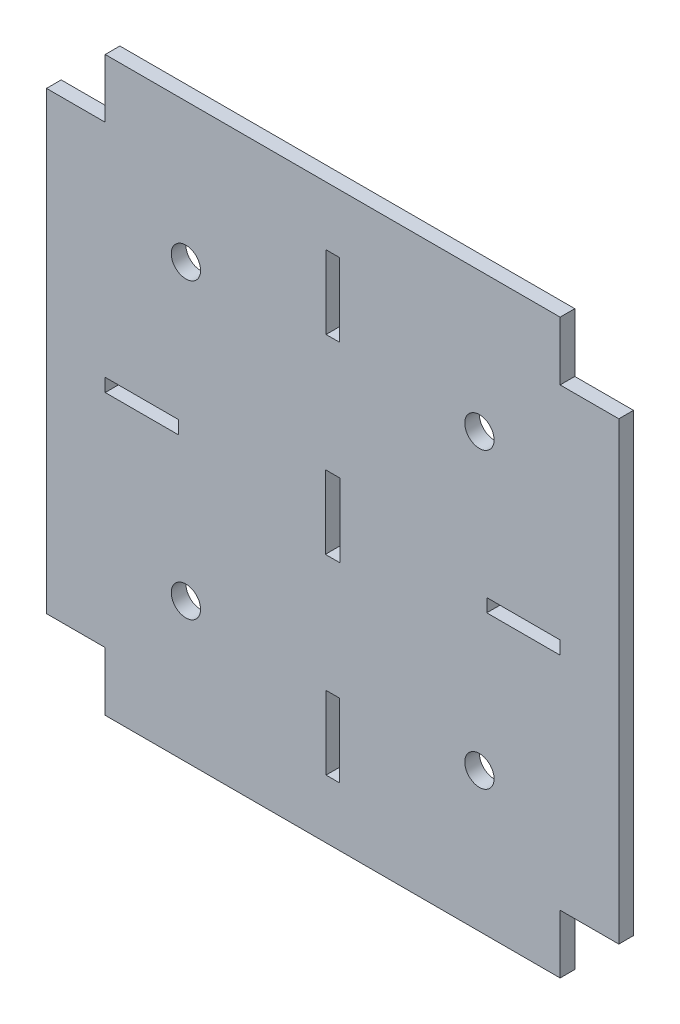
ISO-10303-21;
HEADER;
FILE_DESCRIPTION(('STEP AP214'),'2;1');
FILE_NAME('part.step','',(''),(''),'','','');
FILE_SCHEMA(('AUTOMOTIVE_DESIGN { 1 0 10303 214 1 1 1 1 }'));
ENDSEC;
DATA;
#1=APPLICATION_CONTEXT('core data for automotive mechanical design processes');
#2=APPLICATION_PROTOCOL_DEFINITION('international standard','automotive_design',2000,#1);
#3=PRODUCT_CONTEXT('',#1,'mechanical');
#4=PRODUCT('Part','Part','',(#3));
#5=PRODUCT_RELATED_PRODUCT_CATEGORY('part','',(#4));
#6=PRODUCT_DEFINITION_FORMATION('','',#4);
#7=PRODUCT_DEFINITION_CONTEXT('part definition',#1,'design');
#8=PRODUCT_DEFINITION('design','',#6,#7);
#9=PRODUCT_DEFINITION_SHAPE('','',#8);
#10=(LENGTH_UNIT() NAMED_UNIT(*) SI_UNIT(.MILLI.,.METRE.));
#11=(NAMED_UNIT(*) PLANE_ANGLE_UNIT() SI_UNIT($,.RADIAN.));
#12=(NAMED_UNIT(*) SI_UNIT($,.STERADIAN.) SOLID_ANGLE_UNIT());
#13=UNCERTAINTY_MEASURE_WITH_UNIT(LENGTH_MEASURE(1.E-05),#10,'distance_accuracy_value','');
#14=(GEOMETRIC_REPRESENTATION_CONTEXT(3) GLOBAL_UNCERTAINTY_ASSIGNED_CONTEXT((#13)) GLOBAL_UNIT_ASSIGNED_CONTEXT((#10,
#11,#12)) REPRESENTATION_CONTEXT('',''));
#15=CARTESIAN_POINT('',(0.,0.,0.));
#16=DIRECTION('',(0.,0.,1.));
#17=DIRECTION('',(1.,0.,0.));
#18=AXIS2_PLACEMENT_3D('',#15,#16,#17);
#19=CARTESIAN_POINT('',(0.,0.,2.));
#20=DIRECTION('',(0.,0.,1.));
#21=DIRECTION('',(1.,0.,0.));
#22=AXIS2_PLACEMENT_3D('',#19,#20,#21);
#23=PLANE('',#22);
#24=CARTESIAN_POINT('',(20.0000000000004,-20.,2.));
#25=DIRECTION('',(0.,0.,1.));
#26=DIRECTION('',(1.,0.,0.));
#27=AXIS2_PLACEMENT_3D('',#24,#25,#26);
#28=CIRCLE('',#27,2.);
#29=CARTESIAN_POINT('',(22.0000000000004,-20.,2.));
#30=VERTEX_POINT('',#29);
#31=EDGE_CURVE('E912',#30,#30,#28,.T.);
#32=ORIENTED_EDGE('',*,*,#31,.F.);
#33=EDGE_LOOP('',(#32));
#34=FACE_BOUND('',#33,.T.);
#35=DIRECTION('',(1.,0.,0.));
#36=VECTOR('',#35,1.);
#37=CARTESIAN_POINT('',(-0.999999999999997,-5.,2.));
#38=LINE('',#37,#36);
#39=CARTESIAN_POINT('',(-0.999999999999997,-5.,2.));
#40=VERTEX_POINT('',#39);
#41=CARTESIAN_POINT('',(1.,-5.,2.));
#42=VERTEX_POINT('',#41);
#43=EDGE_CURVE('E250',#40,#42,#38,.T.);
#44=ORIENTED_EDGE('',*,*,#43,.F.);
#45=DIRECTION('',(0.,-1.,0.));
#46=VECTOR('',#45,1.);
#47=CARTESIAN_POINT('',(-0.999999999999997,5.,2.));
#48=LINE('',#47,#46);
#49=CARTESIAN_POINT('',(-0.999999999999997,5.,2.));
#50=VERTEX_POINT('',#49);
#51=EDGE_CURVE('E242',#50,#40,#48,.T.);
#52=ORIENTED_EDGE('',*,*,#51,.F.);
#53=DIRECTION('',(-1.,0.,0.));
#54=VECTOR('',#53,1.);
#55=CARTESIAN_POINT('',(-0.999999999999997,5.,2.));
#56=LINE('',#55,#54);
#57=CARTESIAN_POINT('',(1.,5.,2.));
#58=VERTEX_POINT('',#57);
#59=EDGE_CURVE('E265',#58,#50,#56,.T.);
#60=ORIENTED_EDGE('',*,*,#59,.F.);
#61=DIRECTION('',(0.,1.,0.));
#62=VECTOR('',#61,1.);
#63=CARTESIAN_POINT('',(1.,5.,2.));
#64=LINE('',#63,#62);
#65=EDGE_CURVE('E263',#42,#58,#64,.T.);
#66=ORIENTED_EDGE('',*,*,#65,.F.);
#67=EDGE_LOOP('',(#44,#52,#60,#66));
#68=FACE_BOUND('',#67,.T.);
#69=CARTESIAN_POINT('',(-20.,20.,2.));
#70=DIRECTION('',(0.,0.,1.));
#71=DIRECTION('',(1.,0.,0.));
#72=AXIS2_PLACEMENT_3D('',#69,#70,#71);
#73=CIRCLE('',#72,2.);
#74=CARTESIAN_POINT('',(-18.,20.,2.));
#75=VERTEX_POINT('',#74);
#76=EDGE_CURVE('E281',#75,#75,#73,.T.);
#77=ORIENTED_EDGE('',*,*,#76,.F.);
#78=EDGE_LOOP('',(#77));
#79=FACE_BOUND('',#78,.T.);
#80=DIRECTION('',(0.,-1.,0.));
#81=VECTOR('',#80,1.);
#82=CARTESIAN_POINT('',(-31.,39.,2.));
#83=LINE('',#82,#81);
#84=CARTESIAN_POINT('',(-31.,39.,2.));
#85=VERTEX_POINT('',#84);
#86=CARTESIAN_POINT('',(-31.,31.,2.));
#87=VERTEX_POINT('',#86);
#88=EDGE_CURVE('E411',#85,#87,#83,.T.);
#89=ORIENTED_EDGE('',*,*,#88,.T.);
#90=DIRECTION('',(-1.,0.,0.));
#91=VECTOR('',#90,1.);
#92=CARTESIAN_POINT('',(-39.,31.,2.));
#93=LINE('',#92,#91);
#94=CARTESIAN_POINT('',(-39.,31.,2.));
#95=VERTEX_POINT('',#94);
#96=EDGE_CURVE('E414',#87,#95,#93,.T.);
#97=ORIENTED_EDGE('',*,*,#96,.T.);
#98=DIRECTION('',(0.,-1.,0.));
#99=VECTOR('',#98,1.);
#100=CARTESIAN_POINT('',(-39.,31.,2.));
#101=LINE('',#100,#99);
#102=CARTESIAN_POINT('',(-39.,-31.,2.));
#103=VERTEX_POINT('',#102);
#104=EDGE_CURVE('E417',#95,#103,#101,.T.);
#105=ORIENTED_EDGE('',*,*,#104,.T.);
#106=DIRECTION('',(1.,0.,0.));
#107=VECTOR('',#106,1.);
#108=CARTESIAN_POINT('',(-39.,-31.,2.));
#109=LINE('',#108,#107);
#110=CARTESIAN_POINT('',(-31.,-31.,2.));
#111=VERTEX_POINT('',#110);
#112=EDGE_CURVE('E419',#103,#111,#109,.T.);
#113=ORIENTED_EDGE('',*,*,#112,.T.);
#114=DIRECTION('',(0.,-1.,0.));
#115=VECTOR('',#114,1.);
#116=CARTESIAN_POINT('',(-31.,-39.,2.));
#117=LINE('',#116,#115);
#118=CARTESIAN_POINT('',(-31.,-39.,2.));
#119=VERTEX_POINT('',#118);
#120=EDGE_CURVE('E421',#111,#119,#117,.T.);
#121=ORIENTED_EDGE('',*,*,#120,.T.);
#122=DIRECTION('',(1.,0.,0.));
#123=VECTOR('',#122,1.);
#124=CARTESIAN_POINT('',(-31.,-39.,2.));
#125=LINE('',#124,#123);
#126=CARTESIAN_POINT('',(31.,-39.,2.));
#127=VERTEX_POINT('',#126);
#128=EDGE_CURVE('E423',#119,#127,#125,.T.);
#129=ORIENTED_EDGE('',*,*,#128,.T.);
#130=DIRECTION('',(0.,1.,0.));
#131=VECTOR('',#130,1.);
#132=CARTESIAN_POINT('',(31.,-39.,2.));
#133=LINE('',#132,#131);
#134=CARTESIAN_POINT('',(31.,-31.,2.));
#135=VERTEX_POINT('',#134);
#136=EDGE_CURVE('E425',#127,#135,#133,.T.);
#137=ORIENTED_EDGE('',*,*,#136,.T.);
#138=DIRECTION('',(1.,0.,0.));
#139=VECTOR('',#138,1.);
#140=CARTESIAN_POINT('',(39.,-31.,2.));
#141=LINE('',#140,#139);
#142=CARTESIAN_POINT('',(39.,-31.,2.));
#143=VERTEX_POINT('',#142);
#144=EDGE_CURVE('E427',#135,#143,#141,.T.);
#145=ORIENTED_EDGE('',*,*,#144,.T.);
#146=DIRECTION('',(0.,1.,0.));
#147=VECTOR('',#146,1.);
#148=CARTESIAN_POINT('',(39.,31.,2.));
#149=LINE('',#148,#147);
#150=CARTESIAN_POINT('',(39.,31.,2.));
#151=VERTEX_POINT('',#150);
#152=EDGE_CURVE('E429',#143,#151,#149,.T.);
#153=ORIENTED_EDGE('',*,*,#152,.T.);
#154=DIRECTION('',(-1.,0.,0.));
#155=VECTOR('',#154,1.);
#156=CARTESIAN_POINT('',(39.,31.,2.));
#157=LINE('',#156,#155);
#158=CARTESIAN_POINT('',(31.,31.,2.));
#159=VERTEX_POINT('',#158);
#160=EDGE_CURVE('E431',#151,#159,#157,.T.);
#161=ORIENTED_EDGE('',*,*,#160,.T.);
#162=DIRECTION('',(0.,1.,0.));
#163=VECTOR('',#162,1.);
#164=CARTESIAN_POINT('',(31.,39.,2.));
#165=LINE('',#164,#163);
#166=CARTESIAN_POINT('',(31.,39.,2.));
#167=VERTEX_POINT('',#166);
#168=EDGE_CURVE('E433',#159,#167,#165,.T.);
#169=ORIENTED_EDGE('',*,*,#168,.T.);
#170=DIRECTION('',(-1.,0.,0.));
#171=VECTOR('',#170,1.);
#172=CARTESIAN_POINT('',(-31.,39.,2.));
#173=LINE('',#172,#171);
#174=EDGE_CURVE('E435',#167,#85,#173,.T.);
#175=ORIENTED_EDGE('',*,*,#174,.T.);
#176=EDGE_LOOP('',(#89,#97,#105,#113,#121,#129,#137,#145,#153,#161,#169,#175));
#177=FACE_BOUND('',#176,.T.);
#178=DIRECTION('',(1.,0.,0.));
#179=VECTOR('',#178,1.);
#180=CARTESIAN_POINT('',(-0.900000000000001,21.,2.));
#181=LINE('',#180,#179);
#182=CARTESIAN_POINT('',(-0.900000000000001,21.,2.));
#183=VERTEX_POINT('',#182);
#184=CARTESIAN_POINT('',(0.900000000000001,21.,2.));
#185=VERTEX_POINT('',#184);
#186=EDGE_CURVE('E382',#183,#185,#181,.T.);
#187=ORIENTED_EDGE('',*,*,#186,.F.);
#188=DIRECTION('',(0.,-1.,0.));
#189=VECTOR('',#188,1.);
#190=CARTESIAN_POINT('',(-0.9,31.,2.));
#191=LINE('',#190,#189);
#192=CARTESIAN_POINT('',(-0.9,31.,2.));
#193=VERTEX_POINT('',#192);
#194=EDGE_CURVE('E380',#193,#183,#191,.T.);
#195=ORIENTED_EDGE('',*,*,#194,.F.);
#196=DIRECTION('',(-1.,0.,0.));
#197=VECTOR('',#196,1.);
#198=CARTESIAN_POINT('',(-0.9,31.,2.));
#199=LINE('',#198,#197);
#200=CARTESIAN_POINT('',(0.9,31.,2.));
#201=VERTEX_POINT('',#200);
#202=EDGE_CURVE('E388',#201,#193,#199,.T.);
#203=ORIENTED_EDGE('',*,*,#202,.F.);
#204=DIRECTION('',(0.,1.,0.));
#205=VECTOR('',#204,1.);
#206=CARTESIAN_POINT('',(0.9,31.,2.));
#207=LINE('',#206,#205);
#208=EDGE_CURVE('E385',#185,#201,#207,.T.);
#209=ORIENTED_EDGE('',*,*,#208,.F.);
#210=EDGE_LOOP('',(#187,#195,#203,#209));
#211=FACE_BOUND('',#210,.T.);
#212=DIRECTION('',(1.,0.,0.));
#213=VECTOR('',#212,1.);
#214=CARTESIAN_POINT('',(-31.,-0.900000000000004,2.));
#215=LINE('',#214,#213);
#216=CARTESIAN_POINT('',(-31.,-0.900000000000004,2.));
#217=VERTEX_POINT('',#216);
#218=CARTESIAN_POINT('',(-21.,-0.900000000000001,2.));
#219=VERTEX_POINT('',#218);
#220=EDGE_CURVE('E351',#217,#219,#215,.T.);
#221=ORIENTED_EDGE('',*,*,#220,.F.);
#222=DIRECTION('',(0.,-1.,0.));
#223=VECTOR('',#222,1.);
#224=CARTESIAN_POINT('',(-31.,0.899999999999996,2.));
#225=LINE('',#224,#223);
#226=CARTESIAN_POINT('',(-31.,0.899999999999996,2.));
#227=VERTEX_POINT('',#226);
#228=EDGE_CURVE('E349',#227,#217,#225,.T.);
#229=ORIENTED_EDGE('',*,*,#228,.F.);
#230=DIRECTION('',(-1.,0.,0.));
#231=VECTOR('',#230,1.);
#232=CARTESIAN_POINT('',(-31.,0.899999999999996,2.));
#233=LINE('',#232,#231);
#234=CARTESIAN_POINT('',(-21.,0.899999999999996,2.));
#235=VERTEX_POINT('',#234);
#236=EDGE_CURVE('E357',#235,#227,#233,.T.);
#237=ORIENTED_EDGE('',*,*,#236,.F.);
#238=DIRECTION('',(0.,1.,0.));
#239=VECTOR('',#238,1.);
#240=CARTESIAN_POINT('',(-21.,0.899999999999996,2.));
#241=LINE('',#240,#239);
#242=EDGE_CURVE('E354',#219,#235,#241,.T.);
#243=ORIENTED_EDGE('',*,*,#242,.F.);
#244=EDGE_LOOP('',(#221,#229,#237,#243));
#245=FACE_BOUND('',#244,.T.);
#246=DIRECTION('',(1.,0.,0.));
#247=VECTOR('',#246,1.);
#248=CARTESIAN_POINT('',(-0.900000000000007,-31.,2.));
#249=LINE('',#248,#247);
#250=CARTESIAN_POINT('',(-0.900000000000007,-31.,2.));
#251=VERTEX_POINT('',#250);
#252=CARTESIAN_POINT('',(0.900000000000007,-31.,2.));
#253=VERTEX_POINT('',#252);
#254=EDGE_CURVE('E320',#251,#253,#249,.T.);
#255=ORIENTED_EDGE('',*,*,#254,.F.);
#256=DIRECTION('',(0.,-1.,0.));
#257=VECTOR('',#256,1.);
#258=CARTESIAN_POINT('',(-0.900000000000007,-31.,2.));
#259=LINE('',#258,#257);
#260=CARTESIAN_POINT('',(-0.900000000000006,-21.,2.));
#261=VERTEX_POINT('',#260);
#262=EDGE_CURVE('E318',#261,#251,#259,.T.);
#263=ORIENTED_EDGE('',*,*,#262,.F.);
#264=DIRECTION('',(-1.,0.,0.));
#265=VECTOR('',#264,1.);
#266=CARTESIAN_POINT('',(-0.900000000000006,-21.,2.));
#267=LINE('',#266,#265);
#268=CARTESIAN_POINT('',(0.900000000000006,-21.,2.));
#269=VERTEX_POINT('',#268);
#270=EDGE_CURVE('E326',#269,#261,#267,.T.);
#271=ORIENTED_EDGE('',*,*,#270,.F.);
#272=DIRECTION('',(0.,1.,0.));
#273=VECTOR('',#272,1.);
#274=CARTESIAN_POINT('',(0.900000000000007,-31.,2.));
#275=LINE('',#274,#273);
#276=EDGE_CURVE('E323',#253,#269,#275,.T.);
#277=ORIENTED_EDGE('',*,*,#276,.F.);
#278=EDGE_LOOP('',(#255,#263,#271,#277));
#279=FACE_BOUND('',#278,.T.);
#280=DIRECTION('',(0.,-1.,0.));
#281=VECTOR('',#280,1.);
#282=CARTESIAN_POINT('',(21.,0.900000000000006,2.));
#283=LINE('',#282,#281);
#284=CARTESIAN_POINT('',(21.,0.900000000000006,2.));
#285=VERTEX_POINT('',#284);
#286=CARTESIAN_POINT('',(21.,-0.900000000000001,2.));
#287=VERTEX_POINT('',#286);
#288=EDGE_CURVE('E289',#285,#287,#283,.T.);
#289=ORIENTED_EDGE('',*,*,#288,.F.);
#290=DIRECTION('',(-1.,0.,0.));
#291=VECTOR('',#290,1.);
#292=CARTESIAN_POINT('',(31.,0.900000000000011,2.));
#293=LINE('',#292,#291);
#294=CARTESIAN_POINT('',(31.,0.900000000000011,2.));
#295=VERTEX_POINT('',#294);
#296=EDGE_CURVE('E287',#295,#285,#293,.T.);
#297=ORIENTED_EDGE('',*,*,#296,.F.);
#298=DIRECTION('',(0.,1.,0.));
#299=VECTOR('',#298,1.);
#300=CARTESIAN_POINT('',(31.,0.900000000000011,2.));
#301=LINE('',#300,#299);
#302=CARTESIAN_POINT('',(31.,-0.900000000000004,2.));
#303=VERTEX_POINT('',#302);
#304=EDGE_CURVE('E295',#303,#295,#301,.T.);
#305=ORIENTED_EDGE('',*,*,#304,.F.);
#306=DIRECTION('',(1.,0.,0.));
#307=VECTOR('',#306,1.);
#308=CARTESIAN_POINT('',(31.,-0.900000000000004,2.));
#309=LINE('',#308,#307);
#310=EDGE_CURVE('E292',#287,#303,#309,.T.);
#311=ORIENTED_EDGE('',*,*,#310,.F.);
#312=EDGE_LOOP('',(#289,#297,#305,#311));
#313=FACE_BOUND('',#312,.T.);
#314=CARTESIAN_POINT('',(20.,20.,2.));
#315=DIRECTION('',(0.,0.,1.));
#316=DIRECTION('',(1.,0.,0.));
#317=AXIS2_PLACEMENT_3D('',#314,#315,#316);
#318=CIRCLE('',#317,2.);
#319=CARTESIAN_POINT('',(22.,20.,2.));
#320=VERTEX_POINT('',#319);
#321=EDGE_CURVE('E271',#320,#320,#318,.T.);
#322=ORIENTED_EDGE('',*,*,#321,.F.);
#323=EDGE_LOOP('',(#322));
#324=FACE_BOUND('',#323,.T.);
#325=CARTESIAN_POINT('',(-19.9999999999996,-20.,2.));
#326=DIRECTION('',(0.,0.,1.));
#327=DIRECTION('',(1.,0.,0.));
#328=AXIS2_PLACEMENT_3D('',#325,#326,#327);
#329=CIRCLE('',#328,2.);
#330=CARTESIAN_POINT('',(-17.9999999999996,-20.,2.));
#331=VERTEX_POINT('',#330);
#332=EDGE_CURVE('E903',#331,#331,#329,.T.);
#333=ORIENTED_EDGE('',*,*,#332,.F.);
#334=EDGE_LOOP('',(#333));
#335=FACE_BOUND('',#334,.T.);
#336=ADVANCED_FACE('F33',(#34,#68,#79,#177,#211,#245,#279,#313,#324,#335),#23,.T.);
#337=CARTESIAN_POINT('',(0.,0.,0.));
#338=DIRECTION('',(0.,0.,1.));
#339=DIRECTION('',(1.,0.,0.));
#340=AXIS2_PLACEMENT_3D('',#337,#338,#339);
#341=PLANE('',#340);
#342=CARTESIAN_POINT('',(-20.,20.,0.));
#343=DIRECTION('',(0.,0.,1.));
#344=DIRECTION('',(1.,0.,0.));
#345=AXIS2_PLACEMENT_3D('',#342,#343,#344);
#346=CIRCLE('',#345,2.);
#347=CARTESIAN_POINT('',(-18.,20.,0.));
#348=VERTEX_POINT('',#347);
#349=EDGE_CURVE('E258',#348,#348,#346,.T.);
#350=ORIENTED_EDGE('',*,*,#349,.T.);
#351=EDGE_LOOP('',(#350));
#352=FACE_BOUND('',#351,.T.);
#353=DIRECTION('',(-1.,0.,0.));
#354=VECTOR('',#353,1.);
#355=CARTESIAN_POINT('',(31.,0.900000000000011,0.));
#356=LINE('',#355,#354);
#357=CARTESIAN_POINT('',(31.,0.900000000000011,0.));
#358=VERTEX_POINT('',#357);
#359=CARTESIAN_POINT('',(21.,0.900000000000006,0.));
#360=VERTEX_POINT('',#359);
#361=EDGE_CURVE('E284',#358,#360,#356,.T.);
#362=ORIENTED_EDGE('',*,*,#361,.T.);
#363=DIRECTION('',(0.,-1.,0.));
#364=VECTOR('',#363,1.);
#365=CARTESIAN_POINT('',(21.,0.900000000000006,0.));
#366=LINE('',#365,#364);
#367=CARTESIAN_POINT('',(21.,-0.900000000000001,0.));
#368=VERTEX_POINT('',#367);
#369=EDGE_CURVE('E300',#360,#368,#366,.T.);
#370=ORIENTED_EDGE('',*,*,#369,.T.);
#371=DIRECTION('',(1.,0.,0.));
#372=VECTOR('',#371,1.);
#373=CARTESIAN_POINT('',(31.,-0.900000000000004,0.));
#374=LINE('',#373,#372);
#375=CARTESIAN_POINT('',(31.,-0.900000000000004,0.));
#376=VERTEX_POINT('',#375);
#377=EDGE_CURVE('E303',#368,#376,#374,.T.);
#378=ORIENTED_EDGE('',*,*,#377,.T.);
#379=DIRECTION('',(0.,1.,0.));
#380=VECTOR('',#379,1.);
#381=CARTESIAN_POINT('',(31.,0.900000000000011,0.));
#382=LINE('',#381,#380);
#383=EDGE_CURVE('E290',#376,#358,#382,.T.);
#384=ORIENTED_EDGE('',*,*,#383,.T.);
#385=EDGE_LOOP('',(#362,#370,#378,#384));
#386=FACE_BOUND('',#385,.T.);
#387=DIRECTION('',(0.,-1.,0.));
#388=VECTOR('',#387,1.);
#389=CARTESIAN_POINT('',(-31.,0.899999999999996,0.));
#390=LINE('',#389,#388);
#391=CARTESIAN_POINT('',(-31.,0.899999999999996,0.));
#392=VERTEX_POINT('',#391);
#393=CARTESIAN_POINT('',(-31.,-0.900000000000004,0.));
#394=VERTEX_POINT('',#393);
#395=EDGE_CURVE('E348',#392,#394,#390,.T.);
#396=ORIENTED_EDGE('',*,*,#395,.T.);
#397=DIRECTION('',(1.,0.,0.));
#398=VECTOR('',#397,1.);
#399=CARTESIAN_POINT('',(-31.,-0.900000000000004,0.));
#400=LINE('',#399,#398);
#401=CARTESIAN_POINT('',(-21.,-0.900000000000001,0.));
#402=VERTEX_POINT('',#401);
#403=EDGE_CURVE('E362',#394,#402,#400,.T.);
#404=ORIENTED_EDGE('',*,*,#403,.T.);
#405=DIRECTION('',(0.,1.,0.));
#406=VECTOR('',#405,1.);
#407=CARTESIAN_POINT('',(-21.,0.899999999999996,0.));
#408=LINE('',#407,#406);
#409=CARTESIAN_POINT('',(-21.,0.899999999999996,0.));
#410=VERTEX_POINT('',#409);
#411=EDGE_CURVE('E365',#402,#410,#408,.T.);
#412=ORIENTED_EDGE('',*,*,#411,.T.);
#413=DIRECTION('',(-1.,0.,0.));
#414=VECTOR('',#413,1.);
#415=CARTESIAN_POINT('',(-31.,0.899999999999996,0.));
#416=LINE('',#415,#414);
#417=EDGE_CURVE('E352',#410,#392,#416,.T.);
#418=ORIENTED_EDGE('',*,*,#417,.T.);
#419=EDGE_LOOP('',(#396,#404,#412,#418));
#420=FACE_BOUND('',#419,.T.);
#421=DIRECTION('',(0.,-1.,0.));
#422=VECTOR('',#421,1.);
#423=CARTESIAN_POINT('',(-31.,39.,0.));
#424=LINE('',#423,#422);
#425=CARTESIAN_POINT('',(-31.,39.,0.));
#426=VERTEX_POINT('',#425);
#427=CARTESIAN_POINT('',(-31.,31.,0.));
#428=VERTEX_POINT('',#427);
#429=EDGE_CURVE('E410',#426,#428,#424,.T.);
#430=ORIENTED_EDGE('',*,*,#429,.F.);
#431=DIRECTION('',(-1.,0.,0.));
#432=VECTOR('',#431,1.);
#433=CARTESIAN_POINT('',(-31.,39.,0.));
#434=LINE('',#433,#432);
#435=CARTESIAN_POINT('',(31.,39.,0.));
#436=VERTEX_POINT('',#435);
#437=EDGE_CURVE('E415',#436,#426,#434,.T.);
#438=ORIENTED_EDGE('',*,*,#437,.F.);
#439=DIRECTION('',(0.,1.,0.));
#440=VECTOR('',#439,1.);
#441=CARTESIAN_POINT('',(31.,39.,0.));
#442=LINE('',#441,#440);
#443=CARTESIAN_POINT('',(31.,31.,0.));
#444=VERTEX_POINT('',#443);
#445=EDGE_CURVE('E458',#444,#436,#442,.T.);
#446=ORIENTED_EDGE('',*,*,#445,.F.);
#447=DIRECTION('',(-1.,0.,0.));
#448=VECTOR('',#447,1.);
#449=CARTESIAN_POINT('',(39.,31.,0.));
#450=LINE('',#449,#448);
#451=CARTESIAN_POINT('',(39.,31.,0.));
#452=VERTEX_POINT('',#451);
#453=EDGE_CURVE('E456',#452,#444,#450,.T.);
#454=ORIENTED_EDGE('',*,*,#453,.F.);
#455=DIRECTION('',(0.,1.,0.));
#456=VECTOR('',#455,1.);
#457=CARTESIAN_POINT('',(39.,31.,0.));
#458=LINE('',#457,#456);
#459=CARTESIAN_POINT('',(39.,-31.,0.));
#460=VERTEX_POINT('',#459);
#461=EDGE_CURVE('E454',#460,#452,#458,.T.);
#462=ORIENTED_EDGE('',*,*,#461,.F.);
#463=DIRECTION('',(1.,0.,0.));
#464=VECTOR('',#463,1.);
#465=CARTESIAN_POINT('',(39.,-31.,0.));
#466=LINE('',#465,#464);
#467=CARTESIAN_POINT('',(31.,-31.,0.));
#468=VERTEX_POINT('',#467);
#469=EDGE_CURVE('E452',#468,#460,#466,.T.);
#470=ORIENTED_EDGE('',*,*,#469,.F.);
#471=DIRECTION('',(0.,1.,0.));
#472=VECTOR('',#471,1.);
#473=CARTESIAN_POINT('',(31.,-39.,0.));
#474=LINE('',#473,#472);
#475=CARTESIAN_POINT('',(31.,-39.,0.));
#476=VERTEX_POINT('',#475);
#477=EDGE_CURVE('E450',#476,#468,#474,.T.);
#478=ORIENTED_EDGE('',*,*,#477,.F.);
#479=DIRECTION('',(1.,0.,0.));
#480=VECTOR('',#479,1.);
#481=CARTESIAN_POINT('',(-31.,-39.,0.));
#482=LINE('',#481,#480);
#483=CARTESIAN_POINT('',(-31.,-39.,0.));
#484=VERTEX_POINT('',#483);
#485=EDGE_CURVE('E448',#484,#476,#482,.T.);
#486=ORIENTED_EDGE('',*,*,#485,.F.);
#487=DIRECTION('',(0.,-1.,0.));
#488=VECTOR('',#487,1.);
#489=CARTESIAN_POINT('',(-31.,-39.,0.));
#490=LINE('',#489,#488);
#491=CARTESIAN_POINT('',(-31.,-31.,0.));
#492=VERTEX_POINT('',#491);
#493=EDGE_CURVE('E446',#492,#484,#490,.T.);
#494=ORIENTED_EDGE('',*,*,#493,.F.);
#495=DIRECTION('',(1.,0.,0.));
#496=VECTOR('',#495,1.);
#497=CARTESIAN_POINT('',(-39.,-31.,0.));
#498=LINE('',#497,#496);
#499=CARTESIAN_POINT('',(-39.,-31.,0.));
#500=VERTEX_POINT('',#499);
#501=EDGE_CURVE('E444',#500,#492,#498,.T.);
#502=ORIENTED_EDGE('',*,*,#501,.F.);
#503=DIRECTION('',(0.,-1.,0.));
#504=VECTOR('',#503,1.);
#505=CARTESIAN_POINT('',(-39.,31.,0.));
#506=LINE('',#505,#504);
#507=CARTESIAN_POINT('',(-39.,31.,0.));
#508=VERTEX_POINT('',#507);
#509=EDGE_CURVE('E442',#508,#500,#506,.T.);
#510=ORIENTED_EDGE('',*,*,#509,.F.);
#511=DIRECTION('',(-1.,0.,0.));
#512=VECTOR('',#511,1.);
#513=CARTESIAN_POINT('',(-39.,31.,0.));
#514=LINE('',#513,#512);
#515=EDGE_CURVE('E440',#428,#508,#514,.T.);
#516=ORIENTED_EDGE('',*,*,#515,.F.);
#517=EDGE_LOOP('',(#430,#438,#446,#454,#462,#470,#478,#486,#494,#502,#510,#516));
#518=FACE_BOUND('',#517,.T.);
#519=DIRECTION('',(0.,-1.,0.));
#520=VECTOR('',#519,1.);
#521=CARTESIAN_POINT('',(-0.9,31.,0.));
#522=LINE('',#521,#520);
#523=CARTESIAN_POINT('',(-0.9,31.,0.));
#524=VERTEX_POINT('',#523);
#525=CARTESIAN_POINT('',(-0.900000000000001,21.,0.));
#526=VERTEX_POINT('',#525);
#527=EDGE_CURVE('E379',#524,#526,#522,.T.);
#528=ORIENTED_EDGE('',*,*,#527,.T.);
#529=DIRECTION('',(1.,0.,0.));
#530=VECTOR('',#529,1.);
#531=CARTESIAN_POINT('',(-0.900000000000001,21.,0.));
#532=LINE('',#531,#530);
#533=CARTESIAN_POINT('',(0.900000000000001,21.,0.));
#534=VERTEX_POINT('',#533);
#535=EDGE_CURVE('E393',#526,#534,#532,.T.);
#536=ORIENTED_EDGE('',*,*,#535,.T.);
#537=DIRECTION('',(0.,1.,0.));
#538=VECTOR('',#537,1.);
#539=CARTESIAN_POINT('',(0.9,31.,0.));
#540=LINE('',#539,#538);
#541=CARTESIAN_POINT('',(0.9,31.,0.));
#542=VERTEX_POINT('',#541);
#543=EDGE_CURVE('E396',#534,#542,#540,.T.);
#544=ORIENTED_EDGE('',*,*,#543,.T.);
#545=DIRECTION('',(-1.,0.,0.));
#546=VECTOR('',#545,1.);
#547=CARTESIAN_POINT('',(-0.9,31.,0.));
#548=LINE('',#547,#546);
#549=EDGE_CURVE('E383',#542,#524,#548,.T.);
#550=ORIENTED_EDGE('',*,*,#549,.T.);
#551=EDGE_LOOP('',(#528,#536,#544,#550));
#552=FACE_BOUND('',#551,.T.);
#553=DIRECTION('',(0.,-1.,0.));
#554=VECTOR('',#553,1.);
#555=CARTESIAN_POINT('',(-0.900000000000007,-31.,0.));
#556=LINE('',#555,#554);
#557=CARTESIAN_POINT('',(-0.900000000000006,-21.,0.));
#558=VERTEX_POINT('',#557);
#559=CARTESIAN_POINT('',(-0.900000000000007,-31.,0.));
#560=VERTEX_POINT('',#559);
#561=EDGE_CURVE('E317',#558,#560,#556,.T.);
#562=ORIENTED_EDGE('',*,*,#561,.T.);
#563=DIRECTION('',(1.,0.,0.));
#564=VECTOR('',#563,1.);
#565=CARTESIAN_POINT('',(-0.900000000000007,-31.,0.));
#566=LINE('',#565,#564);
#567=CARTESIAN_POINT('',(0.900000000000007,-31.,0.));
#568=VERTEX_POINT('',#567);
#569=EDGE_CURVE('E331',#560,#568,#566,.T.);
#570=ORIENTED_EDGE('',*,*,#569,.T.);
#571=DIRECTION('',(0.,1.,0.));
#572=VECTOR('',#571,1.);
#573=CARTESIAN_POINT('',(0.900000000000007,-31.,0.));
#574=LINE('',#573,#572);
#575=CARTESIAN_POINT('',(0.900000000000006,-21.,0.));
#576=VERTEX_POINT('',#575);
#577=EDGE_CURVE('E334',#568,#576,#574,.T.);
#578=ORIENTED_EDGE('',*,*,#577,.T.);
#579=DIRECTION('',(-1.,0.,0.));
#580=VECTOR('',#579,1.);
#581=CARTESIAN_POINT('',(-0.900000000000006,-21.,0.));
#582=LINE('',#581,#580);
#583=EDGE_CURVE('E321',#576,#558,#582,.T.);
#584=ORIENTED_EDGE('',*,*,#583,.T.);
#585=EDGE_LOOP('',(#562,#570,#578,#584));
#586=FACE_BOUND('',#585,.T.);
#587=DIRECTION('',(0.,-1.,0.));
#588=VECTOR('',#587,1.);
#589=CARTESIAN_POINT('',(-0.999999999999997,5.,0.));
#590=LINE('',#589,#588);
#591=CARTESIAN_POINT('',(-0.999999999999997,5.,0.));
#592=VERTEX_POINT('',#591);
#593=CARTESIAN_POINT('',(-0.999999999999997,-5.,0.));
#594=VERTEX_POINT('',#593);
#595=EDGE_CURVE('E56',#592,#594,#590,.T.);
#596=ORIENTED_EDGE('',*,*,#595,.T.);
#597=DIRECTION('',(1.,0.,0.));
#598=VECTOR('',#597,1.);
#599=CARTESIAN_POINT('',(-0.999999999999997,-5.,0.));
#600=LINE('',#599,#598);
#601=CARTESIAN_POINT('',(1.,-5.,0.));
#602=VERTEX_POINT('',#601);
#603=EDGE_CURVE('E257',#594,#602,#600,.T.);
#604=ORIENTED_EDGE('',*,*,#603,.T.);
#605=DIRECTION('',(0.,1.,0.));
#606=VECTOR('',#605,1.);
#607=CARTESIAN_POINT('',(1.,5.,0.));
#608=LINE('',#607,#606);
#609=CARTESIAN_POINT('',(1.,5.,0.));
#610=VERTEX_POINT('',#609);
#611=EDGE_CURVE('E273',#602,#610,#608,.T.);
#612=ORIENTED_EDGE('',*,*,#611,.T.);
#613=DIRECTION('',(-1.,0.,0.));
#614=VECTOR('',#613,1.);
#615=CARTESIAN_POINT('',(-0.999999999999997,5.,0.));
#616=LINE('',#615,#614);
#617=EDGE_CURVE('E251',#610,#592,#616,.T.);
#618=ORIENTED_EDGE('',*,*,#617,.T.);
#619=EDGE_LOOP('',(#596,#604,#612,#618));
#620=FACE_BOUND('',#619,.T.);
#621=CARTESIAN_POINT('',(20.,20.,0.));
#622=DIRECTION('',(0.,0.,1.));
#623=DIRECTION('',(1.,0.,0.));
#624=AXIS2_PLACEMENT_3D('',#621,#622,#623);
#625=CIRCLE('',#624,2.);
#626=CARTESIAN_POINT('',(22.,20.,0.));
#627=VERTEX_POINT('',#626);
#628=EDGE_CURVE('E915',#627,#627,#625,.T.);
#629=ORIENTED_EDGE('',*,*,#628,.T.);
#630=EDGE_LOOP('',(#629));
#631=FACE_BOUND('',#630,.T.);
#632=CARTESIAN_POINT('',(20.0000000000004,-20.,0.));
#633=DIRECTION('',(0.,0.,1.));
#634=DIRECTION('',(1.,0.,0.));
#635=AXIS2_PLACEMENT_3D('',#632,#633,#634);
#636=CIRCLE('',#635,2.);
#637=CARTESIAN_POINT('',(22.0000000000004,-20.,0.));
#638=VERTEX_POINT('',#637);
#639=EDGE_CURVE('E909',#638,#638,#636,.T.);
#640=ORIENTED_EDGE('',*,*,#639,.T.);
#641=EDGE_LOOP('',(#640));
#642=FACE_BOUND('',#641,.T.);
#643=CARTESIAN_POINT('',(-19.9999999999996,-20.,0.));
#644=DIRECTION('',(0.,0.,1.));
#645=DIRECTION('',(1.,0.,0.));
#646=AXIS2_PLACEMENT_3D('',#643,#644,#645);
#647=CIRCLE('',#646,2.);
#648=CARTESIAN_POINT('',(-17.9999999999996,-20.,0.));
#649=VERTEX_POINT('',#648);
#650=EDGE_CURVE('E906',#649,#649,#647,.T.);
#651=ORIENTED_EDGE('',*,*,#650,.T.);
#652=EDGE_LOOP('',(#651));
#653=FACE_BOUND('',#652,.T.);
#654=ADVANCED_FACE('F500',(#352,#386,#420,#518,#552,#586,#620,#631,#642,#653),#341,.F.);
#655=CARTESIAN_POINT('',(-31.,39.,2.));
#656=DIRECTION('',(1.,0.,0.));
#657=DIRECTION('',(0.,0.,-1.));
#658=AXIS2_PLACEMENT_3D('',#655,#656,#657);
#659=PLANE('',#658);
#660=ORIENTED_EDGE('',*,*,#429,.T.);
#661=DIRECTION('',(0.,0.,-1.));
#662=VECTOR('',#661,1.);
#663=CARTESIAN_POINT('',(-31.,31.,2.));
#664=LINE('',#663,#662);
#665=EDGE_CURVE('E11',#87,#428,#664,.T.);
#666=ORIENTED_EDGE('',*,*,#665,.F.);
#667=ORIENTED_EDGE('',*,*,#88,.F.);
#668=DIRECTION('',(0.,0.,-1.));
#669=VECTOR('',#668,1.);
#670=CARTESIAN_POINT('',(-31.,39.,2.));
#671=LINE('',#670,#669);
#672=EDGE_CURVE('E437',#85,#426,#671,.T.);
#673=ORIENTED_EDGE('',*,*,#672,.T.);
#674=EDGE_LOOP('',(#660,#666,#667,#673));
#675=FACE_BOUND('',#674,.T.);
#676=ADVANCED_FACE('F35',(#675),#659,.F.);
#677=CARTESIAN_POINT('',(-39.,31.,2.));
#678=DIRECTION('',(0.,-1.,0.));
#679=DIRECTION('',(0.,0.,-1.));
#680=AXIS2_PLACEMENT_3D('',#677,#678,#679);
#681=PLANE('',#680);
#682=ORIENTED_EDGE('',*,*,#515,.T.);
#683=DIRECTION('',(0.,0.,-1.));
#684=VECTOR('',#683,1.);
#685=CARTESIAN_POINT('',(-39.,31.,2.));
#686=LINE('',#685,#684);
#687=EDGE_CURVE('E41',#95,#508,#686,.T.);
#688=ORIENTED_EDGE('',*,*,#687,.F.);
#689=ORIENTED_EDGE('',*,*,#96,.F.);
#690=ORIENTED_EDGE('',*,*,#665,.T.);
#691=EDGE_LOOP('',(#682,#688,#689,#690));
#692=FACE_BOUND('',#691,.T.);
#693=ADVANCED_FACE('F518',(#692),#681,.F.);
#694=CARTESIAN_POINT('',(-39.,31.,2.));
#695=DIRECTION('',(1.,0.,0.));
#696=DIRECTION('',(0.,1.,0.));
#697=AXIS2_PLACEMENT_3D('',#694,#695,#696);
#698=PLANE('',#697);
#699=ORIENTED_EDGE('',*,*,#509,.T.);
#700=DIRECTION('',(0.,0.,-1.));
#701=VECTOR('',#700,1.);
#702=CARTESIAN_POINT('',(-39.,-31.,2.));
#703=LINE('',#702,#701);
#704=EDGE_CURVE('E487',#103,#500,#703,.T.);
#705=ORIENTED_EDGE('',*,*,#704,.F.);
#706=ORIENTED_EDGE('',*,*,#104,.F.);
#707=ORIENTED_EDGE('',*,*,#687,.T.);
#708=EDGE_LOOP('',(#699,#705,#706,#707));
#709=FACE_BOUND('',#708,.T.);
#710=ADVANCED_FACE('F494',(#709),#698,.F.);
#711=CARTESIAN_POINT('',(-39.,-31.,2.));
#712=DIRECTION('',(0.,1.,0.));
#713=DIRECTION('',(-1.,0.,0.));
#714=AXIS2_PLACEMENT_3D('',#711,#712,#713);
#715=PLANE('',#714);
#716=ORIENTED_EDGE('',*,*,#501,.T.);
#717=DIRECTION('',(0.,0.,-1.));
#718=VECTOR('',#717,1.);
#719=CARTESIAN_POINT('',(-31.,-31.,2.));
#720=LINE('',#719,#718);
#721=EDGE_CURVE('E484',#111,#492,#720,.T.);
#722=ORIENTED_EDGE('',*,*,#721,.F.);
#723=ORIENTED_EDGE('',*,*,#112,.F.);
#724=ORIENTED_EDGE('',*,*,#704,.T.);
#725=EDGE_LOOP('',(#716,#722,#723,#724));
#726=FACE_BOUND('',#725,.T.);
#727=ADVANCED_FACE('F506',(#726),#715,.F.);
#728=CARTESIAN_POINT('',(-31.,-39.,2.));
#729=DIRECTION('',(1.,0.,0.));
#730=DIRECTION('',(0.,1.,0.));
#731=AXIS2_PLACEMENT_3D('',#728,#729,#730);
#732=PLANE('',#731);
#733=ORIENTED_EDGE('',*,*,#493,.T.);
#734=DIRECTION('',(0.,0.,-1.));
#735=VECTOR('',#734,1.);
#736=CARTESIAN_POINT('',(-31.,-39.,2.));
#737=LINE('',#736,#735);
#738=EDGE_CURVE('E481',#119,#484,#737,.T.);
#739=ORIENTED_EDGE('',*,*,#738,.F.);
#740=ORIENTED_EDGE('',*,*,#120,.F.);
#741=ORIENTED_EDGE('',*,*,#721,.T.);
#742=EDGE_LOOP('',(#733,#739,#740,#741));
#743=FACE_BOUND('',#742,.T.);
#744=ADVANCED_FACE('F510',(#743),#732,.F.);
#745=CARTESIAN_POINT('',(-31.,-39.,2.));
#746=DIRECTION('',(0.,1.,0.));
#747=DIRECTION('',(-1.,0.,0.));
#748=AXIS2_PLACEMENT_3D('',#745,#746,#747);
#749=PLANE('',#748);
#750=ORIENTED_EDGE('',*,*,#485,.T.);
#751=DIRECTION('',(0.,0.,-1.));
#752=VECTOR('',#751,1.);
#753=CARTESIAN_POINT('',(31.,-39.,2.));
#754=LINE('',#753,#752);
#755=EDGE_CURVE('E478',#127,#476,#754,.T.);
#756=ORIENTED_EDGE('',*,*,#755,.F.);
#757=ORIENTED_EDGE('',*,*,#128,.F.);
#758=ORIENTED_EDGE('',*,*,#738,.T.);
#759=EDGE_LOOP('',(#750,#756,#757,#758));
#760=FACE_BOUND('',#759,.T.);
#761=ADVANCED_FACE('F551',(#760),#749,.F.);
#762=CARTESIAN_POINT('',(31.,-39.,2.));
#763=DIRECTION('',(-1.,0.,0.));
#764=DIRECTION('',(0.,0.,1.));
#765=AXIS2_PLACEMENT_3D('',#762,#763,#764);
#766=PLANE('',#765);
#767=ORIENTED_EDGE('',*,*,#477,.T.);
#768=DIRECTION('',(0.,0.,-1.));
#769=VECTOR('',#768,1.);
#770=CARTESIAN_POINT('',(31.,-31.,2.));
#771=LINE('',#770,#769);
#772=EDGE_CURVE('E475',#135,#468,#771,.T.);
#773=ORIENTED_EDGE('',*,*,#772,.F.);
#774=ORIENTED_EDGE('',*,*,#136,.F.);
#775=ORIENTED_EDGE('',*,*,#755,.T.);
#776=EDGE_LOOP('',(#767,#773,#774,#775));
#777=FACE_BOUND('',#776,.T.);
#778=ADVANCED_FACE('F549',(#777),#766,.F.);
#779=CARTESIAN_POINT('',(39.,-31.,2.));
#780=DIRECTION('',(0.,1.,0.));
#781=DIRECTION('',(-1.,0.,0.));
#782=AXIS2_PLACEMENT_3D('',#779,#780,#781);
#783=PLANE('',#782);
#784=ORIENTED_EDGE('',*,*,#469,.T.);
#785=DIRECTION('',(0.,0.,-1.));
#786=VECTOR('',#785,1.);
#787=CARTESIAN_POINT('',(39.,-31.,2.));
#788=LINE('',#787,#786);
#789=EDGE_CURVE('E472',#143,#460,#788,.T.);
#790=ORIENTED_EDGE('',*,*,#789,.F.);
#791=ORIENTED_EDGE('',*,*,#144,.F.);
#792=ORIENTED_EDGE('',*,*,#772,.T.);
#793=EDGE_LOOP('',(#784,#790,#791,#792));
#794=FACE_BOUND('',#793,.T.);
#795=ADVANCED_FACE('F545',(#794),#783,.F.);
#796=CARTESIAN_POINT('',(39.,31.,2.));
#797=DIRECTION('',(-1.,0.,0.));
#798=DIRECTION('',(0.,-1.,0.));
#799=AXIS2_PLACEMENT_3D('',#796,#797,#798);
#800=PLANE('',#799);
#801=ORIENTED_EDGE('',*,*,#461,.T.);
#802=DIRECTION('',(0.,0.,-1.));
#803=VECTOR('',#802,1.);
#804=CARTESIAN_POINT('',(39.,31.,2.));
#805=LINE('',#804,#803);
#806=EDGE_CURVE('E469',#151,#452,#805,.T.);
#807=ORIENTED_EDGE('',*,*,#806,.F.);
#808=ORIENTED_EDGE('',*,*,#152,.F.);
#809=ORIENTED_EDGE('',*,*,#789,.T.);
#810=EDGE_LOOP('',(#801,#807,#808,#809));
#811=FACE_BOUND('',#810,.T.);
#812=ADVANCED_FACE('F540',(#811),#800,.F.);
#813=CARTESIAN_POINT('',(39.,31.,2.));
#814=DIRECTION('',(0.,-1.,0.));
#815=DIRECTION('',(1.,0.,0.));
#816=AXIS2_PLACEMENT_3D('',#813,#814,#815);
#817=PLANE('',#816);
#818=ORIENTED_EDGE('',*,*,#453,.T.);
#819=DIRECTION('',(0.,0.,-1.));
#820=VECTOR('',#819,1.);
#821=CARTESIAN_POINT('',(31.,31.,2.));
#822=LINE('',#821,#820);
#823=EDGE_CURVE('E466',#159,#444,#822,.T.);
#824=ORIENTED_EDGE('',*,*,#823,.F.);
#825=ORIENTED_EDGE('',*,*,#160,.F.);
#826=ORIENTED_EDGE('',*,*,#806,.T.);
#827=EDGE_LOOP('',(#818,#824,#825,#826));
#828=FACE_BOUND('',#827,.T.);
#829=ADVANCED_FACE('F534',(#828),#817,.F.);
#830=CARTESIAN_POINT('',(31.,39.,2.));
#831=DIRECTION('',(-1.,0.,0.));
#832=DIRECTION('',(0.,-1.,0.));
#833=AXIS2_PLACEMENT_3D('',#830,#831,#832);
#834=PLANE('',#833);
#835=ORIENTED_EDGE('',*,*,#445,.T.);
#836=DIRECTION('',(0.,0.,-1.));
#837=VECTOR('',#836,1.);
#838=CARTESIAN_POINT('',(31.,39.,2.));
#839=LINE('',#838,#837);
#840=EDGE_CURVE('E463',#167,#436,#839,.T.);
#841=ORIENTED_EDGE('',*,*,#840,.F.);
#842=ORIENTED_EDGE('',*,*,#168,.F.);
#843=ORIENTED_EDGE('',*,*,#823,.T.);
#844=EDGE_LOOP('',(#835,#841,#842,#843));
#845=FACE_BOUND('',#844,.T.);
#846=ADVANCED_FACE('F530',(#845),#834,.F.);
#847=CARTESIAN_POINT('',(-31.,39.,2.));
#848=DIRECTION('',(0.,-1.,0.));
#849=DIRECTION('',(0.,0.,-1.));
#850=AXIS2_PLACEMENT_3D('',#847,#848,#849);
#851=PLANE('',#850);
#852=ORIENTED_EDGE('',*,*,#437,.T.);
#853=ORIENTED_EDGE('',*,*,#672,.F.);
#854=ORIENTED_EDGE('',*,*,#174,.F.);
#855=ORIENTED_EDGE('',*,*,#840,.T.);
#856=EDGE_LOOP('',(#852,#853,#854,#855));
#857=FACE_BOUND('',#856,.T.);
#858=ADVANCED_FACE('F525',(#857),#851,.F.);
#859=CARTESIAN_POINT('',(-0.9,31.,2.));
#860=DIRECTION('',(1.,0.,0.));
#861=DIRECTION('',(0.,1.,0.));
#862=AXIS2_PLACEMENT_3D('',#859,#860,#861);
#863=PLANE('',#862);
#864=ORIENTED_EDGE('',*,*,#527,.F.);
#865=DIRECTION('',(0.,0.,-1.));
#866=VECTOR('',#865,1.);
#867=CARTESIAN_POINT('',(-0.9,31.,2.));
#868=LINE('',#867,#866);
#869=EDGE_CURVE('E390',#193,#524,#868,.T.);
#870=ORIENTED_EDGE('',*,*,#869,.F.);
#871=ORIENTED_EDGE('',*,*,#194,.T.);
#872=DIRECTION('',(0.,0.,-1.));
#873=VECTOR('',#872,1.);
#874=CARTESIAN_POINT('',(-0.900000000000001,21.,2.));
#875=LINE('',#874,#873);
#876=EDGE_CURVE('E407',#183,#526,#875,.T.);
#877=ORIENTED_EDGE('',*,*,#876,.T.);
#878=EDGE_LOOP('',(#864,#870,#871,#877));
#879=FACE_BOUND('',#878,.T.);
#880=ADVANCED_FACE('F570',(#879),#863,.T.);
#881=CARTESIAN_POINT('',(-0.900000000000001,21.,2.));
#882=DIRECTION('',(0.,1.,0.));
#883=DIRECTION('',(0.,0.,1.));
#884=AXIS2_PLACEMENT_3D('',#881,#882,#883);
#885=PLANE('',#884);
#886=ORIENTED_EDGE('',*,*,#535,.F.);
#887=ORIENTED_EDGE('',*,*,#876,.F.);
#888=ORIENTED_EDGE('',*,*,#186,.T.);
#889=DIRECTION('',(0.,0.,-1.));
#890=VECTOR('',#889,1.);
#891=CARTESIAN_POINT('',(0.900000000000001,21.,2.));
#892=LINE('',#891,#890);
#893=EDGE_CURVE('E405',#185,#534,#892,.T.);
#894=ORIENTED_EDGE('',*,*,#893,.T.);
#895=EDGE_LOOP('',(#886,#887,#888,#894));
#896=FACE_BOUND('',#895,.T.);
#897=ADVANCED_FACE('F608',(#896),#885,.T.);
#898=CARTESIAN_POINT('',(0.9,31.,2.));
#899=DIRECTION('',(-1.,0.,0.));
#900=DIRECTION('',(0.,-1.,0.));
#901=AXIS2_PLACEMENT_3D('',#898,#899,#900);
#902=PLANE('',#901);
#903=ORIENTED_EDGE('',*,*,#543,.F.);
#904=ORIENTED_EDGE('',*,*,#893,.F.);
#905=ORIENTED_EDGE('',*,*,#208,.T.);
#906=DIRECTION('',(0.,0.,-1.));
#907=VECTOR('',#906,1.);
#908=CARTESIAN_POINT('',(0.9,31.,2.));
#909=LINE('',#908,#907);
#910=EDGE_CURVE('E403',#201,#542,#909,.T.);
#911=ORIENTED_EDGE('',*,*,#910,.T.);
#912=EDGE_LOOP('',(#903,#904,#905,#911));
#913=FACE_BOUND('',#912,.T.);
#914=ADVANCED_FACE('F615',(#913),#902,.T.);
#915=CARTESIAN_POINT('',(-0.9,31.,2.));
#916=DIRECTION('',(0.,-1.,0.));
#917=DIRECTION('',(0.,0.,-1.));
#918=AXIS2_PLACEMENT_3D('',#915,#916,#917);
#919=PLANE('',#918);
#920=ORIENTED_EDGE('',*,*,#549,.F.);
#921=ORIENTED_EDGE('',*,*,#910,.F.);
#922=ORIENTED_EDGE('',*,*,#202,.T.);
#923=ORIENTED_EDGE('',*,*,#869,.T.);
#924=EDGE_LOOP('',(#920,#921,#922,#923));
#925=FACE_BOUND('',#924,.T.);
#926=ADVANCED_FACE('F622',(#925),#919,.T.);
#927=CARTESIAN_POINT('',(-31.,0.899999999999996,2.));
#928=DIRECTION('',(1.,0.,0.));
#929=DIRECTION('',(0.,0.,-1.));
#930=AXIS2_PLACEMENT_3D('',#927,#928,#929);
#931=PLANE('',#930);
#932=ORIENTED_EDGE('',*,*,#395,.F.);
#933=DIRECTION('',(0.,0.,-1.));
#934=VECTOR('',#933,1.);
#935=CARTESIAN_POINT('',(-31.,0.899999999999996,2.));
#936=LINE('',#935,#934);
#937=EDGE_CURVE('E359',#227,#392,#936,.T.);
#938=ORIENTED_EDGE('',*,*,#937,.F.);
#939=ORIENTED_EDGE('',*,*,#228,.T.);
#940=DIRECTION('',(0.,0.,-1.));
#941=VECTOR('',#940,1.);
#942=CARTESIAN_POINT('',(-31.,-0.900000000000004,2.));
#943=LINE('',#942,#941);
#944=EDGE_CURVE('E376',#217,#394,#943,.T.);
#945=ORIENTED_EDGE('',*,*,#944,.T.);
#946=EDGE_LOOP('',(#932,#938,#939,#945));
#947=FACE_BOUND('',#946,.T.);
#948=ADVANCED_FACE('F630',(#947),#931,.T.);
#949=CARTESIAN_POINT('',(-31.,-0.900000000000004,2.));
#950=DIRECTION('',(0.,1.,0.));
#951=DIRECTION('',(-1.,0.,0.));
#952=AXIS2_PLACEMENT_3D('',#949,#950,#951);
#953=PLANE('',#952);
#954=ORIENTED_EDGE('',*,*,#403,.F.);
#955=ORIENTED_EDGE('',*,*,#944,.F.);
#956=ORIENTED_EDGE('',*,*,#220,.T.);
#957=DIRECTION('',(0.,0.,-1.));
#958=VECTOR('',#957,1.);
#959=CARTESIAN_POINT('',(-21.,-0.900000000000001,2.));
#960=LINE('',#959,#958);
#961=EDGE_CURVE('E374',#219,#402,#960,.T.);
#962=ORIENTED_EDGE('',*,*,#961,.T.);
#963=EDGE_LOOP('',(#954,#955,#956,#962));
#964=FACE_BOUND('',#963,.T.);
#965=ADVANCED_FACE('F638',(#964),#953,.T.);
#966=CARTESIAN_POINT('',(-21.,0.899999999999996,2.));
#967=DIRECTION('',(-1.,0.,0.));
#968=DIRECTION('',(0.,0.,1.));
#969=AXIS2_PLACEMENT_3D('',#966,#967,#968);
#970=PLANE('',#969);
#971=ORIENTED_EDGE('',*,*,#411,.F.);
#972=ORIENTED_EDGE('',*,*,#961,.F.);
#973=ORIENTED_EDGE('',*,*,#242,.T.);
#974=DIRECTION('',(0.,0.,-1.));
#975=VECTOR('',#974,1.);
#976=CARTESIAN_POINT('',(-21.,0.899999999999996,2.));
#977=LINE('',#976,#975);
#978=EDGE_CURVE('E372',#235,#410,#977,.T.);
#979=ORIENTED_EDGE('',*,*,#978,.T.);
#980=EDGE_LOOP('',(#971,#972,#973,#979));
#981=FACE_BOUND('',#980,.T.);
#982=ADVANCED_FACE('F646',(#981),#970,.T.);
#983=CARTESIAN_POINT('',(-31.,0.899999999999996,2.));
#984=DIRECTION('',(0.,-1.,0.));
#985=DIRECTION('',(1.,0.,0.));
#986=AXIS2_PLACEMENT_3D('',#983,#984,#985);
#987=PLANE('',#986);
#988=ORIENTED_EDGE('',*,*,#417,.F.);
#989=ORIENTED_EDGE('',*,*,#978,.F.);
#990=ORIENTED_EDGE('',*,*,#236,.T.);
#991=ORIENTED_EDGE('',*,*,#937,.T.);
#992=EDGE_LOOP('',(#988,#989,#990,#991));
#993=FACE_BOUND('',#992,.T.);
#994=ADVANCED_FACE('F654',(#993),#987,.T.);
#995=CARTESIAN_POINT('',(-0.900000000000007,-31.,2.));
#996=DIRECTION('',(1.,0.,0.));
#997=DIRECTION('',(0.,1.,0.));
#998=AXIS2_PLACEMENT_3D('',#995,#996,#997);
#999=PLANE('',#998);
#1000=ORIENTED_EDGE('',*,*,#561,.F.);
#1001=DIRECTION('',(0.,0.,-1.));
#1002=VECTOR('',#1001,1.);
#1003=CARTESIAN_POINT('',(-0.900000000000006,-21.,2.));
#1004=LINE('',#1003,#1002);
#1005=EDGE_CURVE('E328',#261,#558,#1004,.T.);
#1006=ORIENTED_EDGE('',*,*,#1005,.F.);
#1007=ORIENTED_EDGE('',*,*,#262,.T.);
#1008=DIRECTION('',(0.,0.,-1.));
#1009=VECTOR('',#1008,1.);
#1010=CARTESIAN_POINT('',(-0.900000000000007,-31.,2.));
#1011=LINE('',#1010,#1009);
#1012=EDGE_CURVE('E345',#251,#560,#1011,.T.);
#1013=ORIENTED_EDGE('',*,*,#1012,.T.);
#1014=EDGE_LOOP('',(#1000,#1006,#1007,#1013));
#1015=FACE_BOUND('',#1014,.T.);
#1016=ADVANCED_FACE('F662',(#1015),#999,.T.);
#1017=CARTESIAN_POINT('',(-0.900000000000007,-31.,2.));
#1018=DIRECTION('',(0.,1.,0.));
#1019=DIRECTION('',(0.,0.,1.));
#1020=AXIS2_PLACEMENT_3D('',#1017,#1018,#1019);
#1021=PLANE('',#1020);
#1022=ORIENTED_EDGE('',*,*,#569,.F.);
#1023=ORIENTED_EDGE('',*,*,#1012,.F.);
#1024=ORIENTED_EDGE('',*,*,#254,.T.);
#1025=DIRECTION('',(0.,0.,-1.));
#1026=VECTOR('',#1025,1.);
#1027=CARTESIAN_POINT('',(0.900000000000007,-31.,2.));
#1028=LINE('',#1027,#1026);
#1029=EDGE_CURVE('E343',#253,#568,#1028,.T.);
#1030=ORIENTED_EDGE('',*,*,#1029,.T.);
#1031=EDGE_LOOP('',(#1022,#1023,#1024,#1030));
#1032=FACE_BOUND('',#1031,.T.);
#1033=ADVANCED_FACE('F670',(#1032),#1021,.T.);
#1034=CARTESIAN_POINT('',(0.900000000000007,-31.,2.));
#1035=DIRECTION('',(-1.,0.,0.));
#1036=DIRECTION('',(0.,-1.,0.));
#1037=AXIS2_PLACEMENT_3D('',#1034,#1035,#1036);
#1038=PLANE('',#1037);
#1039=ORIENTED_EDGE('',*,*,#577,.F.);
#1040=ORIENTED_EDGE('',*,*,#1029,.F.);
#1041=ORIENTED_EDGE('',*,*,#276,.T.);
#1042=DIRECTION('',(0.,0.,-1.));
#1043=VECTOR('',#1042,1.);
#1044=CARTESIAN_POINT('',(0.900000000000006,-21.,2.));
#1045=LINE('',#1044,#1043);
#1046=EDGE_CURVE('E341',#269,#576,#1045,.T.);
#1047=ORIENTED_EDGE('',*,*,#1046,.T.);
#1048=EDGE_LOOP('',(#1039,#1040,#1041,#1047));
#1049=FACE_BOUND('',#1048,.T.);
#1050=ADVANCED_FACE('F678',(#1049),#1038,.T.);
#1051=CARTESIAN_POINT('',(-0.900000000000006,-21.,2.));
#1052=DIRECTION('',(0.,-1.,0.));
#1053=DIRECTION('',(0.,0.,-1.));
#1054=AXIS2_PLACEMENT_3D('',#1051,#1052,#1053);
#1055=PLANE('',#1054);
#1056=ORIENTED_EDGE('',*,*,#583,.F.);
#1057=ORIENTED_EDGE('',*,*,#1046,.F.);
#1058=ORIENTED_EDGE('',*,*,#270,.T.);
#1059=ORIENTED_EDGE('',*,*,#1005,.T.);
#1060=EDGE_LOOP('',(#1056,#1057,#1058,#1059));
#1061=FACE_BOUND('',#1060,.T.);
#1062=ADVANCED_FACE('F686',(#1061),#1055,.T.);
#1063=CARTESIAN_POINT('',(31.,0.900000000000011,2.));
#1064=DIRECTION('',(0.,-1.,0.));
#1065=DIRECTION('',(1.,0.,0.));
#1066=AXIS2_PLACEMENT_3D('',#1063,#1064,#1065);
#1067=PLANE('',#1066);
#1068=ORIENTED_EDGE('',*,*,#361,.F.);
#1069=DIRECTION('',(0.,0.,-1.));
#1070=VECTOR('',#1069,1.);
#1071=CARTESIAN_POINT('',(31.,0.900000000000011,2.));
#1072=LINE('',#1071,#1070);
#1073=EDGE_CURVE('E297',#295,#358,#1072,.T.);
#1074=ORIENTED_EDGE('',*,*,#1073,.F.);
#1075=ORIENTED_EDGE('',*,*,#296,.T.);
#1076=DIRECTION('',(0.,0.,-1.));
#1077=VECTOR('',#1076,1.);
#1078=CARTESIAN_POINT('',(21.,0.900000000000006,2.));
#1079=LINE('',#1078,#1077);
#1080=EDGE_CURVE('E314',#285,#360,#1079,.T.);
#1081=ORIENTED_EDGE('',*,*,#1080,.T.);
#1082=EDGE_LOOP('',(#1068,#1074,#1075,#1081));
#1083=FACE_BOUND('',#1082,.T.);
#1084=ADVANCED_FACE('F694',(#1083),#1067,.T.);
#1085=CARTESIAN_POINT('',(21.,0.900000000000006,2.));
#1086=DIRECTION('',(1.,0.,0.));
#1087=DIRECTION('',(0.,0.,-1.));
#1088=AXIS2_PLACEMENT_3D('',#1085,#1086,#1087);
#1089=PLANE('',#1088);
#1090=ORIENTED_EDGE('',*,*,#369,.F.);
#1091=ORIENTED_EDGE('',*,*,#1080,.F.);
#1092=ORIENTED_EDGE('',*,*,#288,.T.);
#1093=DIRECTION('',(0.,0.,-1.));
#1094=VECTOR('',#1093,1.);
#1095=CARTESIAN_POINT('',(21.,-0.900000000000001,2.));
#1096=LINE('',#1095,#1094);
#1097=EDGE_CURVE('E312',#287,#368,#1096,.T.);
#1098=ORIENTED_EDGE('',*,*,#1097,.T.);
#1099=EDGE_LOOP('',(#1090,#1091,#1092,#1098));
#1100=FACE_BOUND('',#1099,.T.);
#1101=ADVANCED_FACE('F702',(#1100),#1089,.T.);
#1102=CARTESIAN_POINT('',(31.,-0.900000000000004,2.));
#1103=DIRECTION('',(0.,1.,0.));
#1104=DIRECTION('',(-1.,0.,0.));
#1105=AXIS2_PLACEMENT_3D('',#1102,#1103,#1104);
#1106=PLANE('',#1105);
#1107=ORIENTED_EDGE('',*,*,#377,.F.);
#1108=ORIENTED_EDGE('',*,*,#1097,.F.);
#1109=ORIENTED_EDGE('',*,*,#310,.T.);
#1110=DIRECTION('',(0.,0.,-1.));
#1111=VECTOR('',#1110,1.);
#1112=CARTESIAN_POINT('',(31.,-0.900000000000004,2.));
#1113=LINE('',#1112,#1111);
#1114=EDGE_CURVE('E310',#303,#376,#1113,.T.);
#1115=ORIENTED_EDGE('',*,*,#1114,.T.);
#1116=EDGE_LOOP('',(#1107,#1108,#1109,#1115));
#1117=FACE_BOUND('',#1116,.T.);
#1118=ADVANCED_FACE('F710',(#1117),#1106,.T.);
#1119=CARTESIAN_POINT('',(31.,0.900000000000011,2.));
#1120=DIRECTION('',(-1.,0.,0.));
#1121=DIRECTION('',(0.,0.,1.));
#1122=AXIS2_PLACEMENT_3D('',#1119,#1120,#1121);
#1123=PLANE('',#1122);
#1124=ORIENTED_EDGE('',*,*,#383,.F.);
#1125=ORIENTED_EDGE('',*,*,#1114,.F.);
#1126=ORIENTED_EDGE('',*,*,#304,.T.);
#1127=ORIENTED_EDGE('',*,*,#1073,.T.);
#1128=EDGE_LOOP('',(#1124,#1125,#1126,#1127));
#1129=FACE_BOUND('',#1128,.T.);
#1130=ADVANCED_FACE('F718',(#1129),#1123,.T.);
#1131=CARTESIAN_POINT('',(-20.,20.,2.));
#1132=DIRECTION('',(0.,0.,-1.));
#1133=DIRECTION('',(-1.,0.,0.));
#1134=AXIS2_PLACEMENT_3D('',#1131,#1132,#1133);
#1135=CYLINDRICAL_SURFACE('',#1134,2.);
#1136=ORIENTED_EDGE('',*,*,#76,.T.);
#1137=EDGE_LOOP('',(#1136));
#1138=FACE_BOUND('',#1137,.T.);
#1139=ORIENTED_EDGE('',*,*,#349,.F.);
#1140=EDGE_LOOP('',(#1139));
#1141=FACE_BOUND('',#1140,.T.);
#1142=ADVANCED_FACE('F726',(#1138,#1141),#1135,.F.);
#1143=CARTESIAN_POINT('',(-0.999999999999997,5.,2.));
#1144=DIRECTION('',(1.,0.,0.));
#1145=DIRECTION('',(0.,0.,-1.));
#1146=AXIS2_PLACEMENT_3D('',#1143,#1144,#1145);
#1147=PLANE('',#1146);
#1148=ORIENTED_EDGE('',*,*,#595,.F.);
#1149=DIRECTION('',(0.,0.,-1.));
#1150=VECTOR('',#1149,1.);
#1151=CARTESIAN_POINT('',(-0.999999999999997,5.,2.));
#1152=LINE('',#1151,#1150);
#1153=EDGE_CURVE('E246',#50,#592,#1152,.T.);
#1154=ORIENTED_EDGE('',*,*,#1153,.F.);
#1155=ORIENTED_EDGE('',*,*,#51,.T.);
#1156=DIRECTION('',(0.,0.,-1.));
#1157=VECTOR('',#1156,1.);
#1158=CARTESIAN_POINT('',(-0.999999999999997,-5.,2.));
#1159=LINE('',#1158,#1157);
#1160=EDGE_CURVE('E245',#40,#594,#1159,.T.);
#1161=ORIENTED_EDGE('',*,*,#1160,.T.);
#1162=EDGE_LOOP('',(#1148,#1154,#1155,#1161));
#1163=FACE_BOUND('',#1162,.T.);
#1164=ADVANCED_FACE('F244',(#1163),#1147,.T.);
#1165=CARTESIAN_POINT('',(-0.999999999999997,-5.,2.));
#1166=DIRECTION('',(0.,1.,0.));
#1167=DIRECTION('',(0.,0.,1.));
#1168=AXIS2_PLACEMENT_3D('',#1165,#1166,#1167);
#1169=PLANE('',#1168);
#1170=ORIENTED_EDGE('',*,*,#603,.F.);
#1171=ORIENTED_EDGE('',*,*,#1160,.F.);
#1172=ORIENTED_EDGE('',*,*,#43,.T.);
#1173=DIRECTION('',(0.,0.,-1.));
#1174=VECTOR('',#1173,1.);
#1175=CARTESIAN_POINT('',(1.,-5.,2.));
#1176=LINE('',#1175,#1174);
#1177=EDGE_CURVE('E259',#42,#602,#1176,.T.);
#1178=ORIENTED_EDGE('',*,*,#1177,.T.);
#1179=EDGE_LOOP('',(#1170,#1171,#1172,#1178));
#1180=FACE_BOUND('',#1179,.T.);
#1181=ADVANCED_FACE('F254',(#1180),#1169,.T.);
#1182=CARTESIAN_POINT('',(1.,5.,2.));
#1183=DIRECTION('',(-1.,0.,0.));
#1184=DIRECTION('',(0.,0.,1.));
#1185=AXIS2_PLACEMENT_3D('',#1182,#1183,#1184);
#1186=PLANE('',#1185);
#1187=ORIENTED_EDGE('',*,*,#611,.F.);
#1188=ORIENTED_EDGE('',*,*,#1177,.F.);
#1189=ORIENTED_EDGE('',*,*,#65,.T.);
#1190=DIRECTION('',(0.,0.,-1.));
#1191=VECTOR('',#1190,1.);
#1192=CARTESIAN_POINT('',(1.,5.,2.));
#1193=LINE('',#1192,#1191);
#1194=EDGE_CURVE('E48',#58,#610,#1193,.T.);
#1195=ORIENTED_EDGE('',*,*,#1194,.T.);
#1196=EDGE_LOOP('',(#1187,#1188,#1189,#1195));
#1197=FACE_BOUND('',#1196,.T.);
#1198=ADVANCED_FACE('F747',(#1197),#1186,.T.);
#1199=CARTESIAN_POINT('',(-0.999999999999997,5.,2.));
#1200=DIRECTION('',(0.,-1.,0.));
#1201=DIRECTION('',(0.,0.,-1.));
#1202=AXIS2_PLACEMENT_3D('',#1199,#1200,#1201);
#1203=PLANE('',#1202);
#1204=ORIENTED_EDGE('',*,*,#617,.F.);
#1205=ORIENTED_EDGE('',*,*,#1194,.F.);
#1206=ORIENTED_EDGE('',*,*,#59,.T.);
#1207=ORIENTED_EDGE('',*,*,#1153,.T.);
#1208=EDGE_LOOP('',(#1204,#1205,#1206,#1207));
#1209=FACE_BOUND('',#1208,.T.);
#1210=ADVANCED_FACE('F754',(#1209),#1203,.T.);
#1211=CARTESIAN_POINT('',(20.,20.,2.));
#1212=DIRECTION('',(0.,0.,-1.));
#1213=DIRECTION('',(-1.,0.,0.));
#1214=AXIS2_PLACEMENT_3D('',#1211,#1212,#1213);
#1215=CYLINDRICAL_SURFACE('',#1214,2.);
#1216=ORIENTED_EDGE('',*,*,#321,.T.);
#1217=EDGE_LOOP('',(#1216));
#1218=FACE_BOUND('',#1217,.T.);
#1219=ORIENTED_EDGE('',*,*,#628,.F.);
#1220=EDGE_LOOP('',(#1219));
#1221=FACE_BOUND('',#1220,.T.);
#1222=ADVANCED_FACE('F762',(#1218,#1221),#1215,.F.);
#1223=CARTESIAN_POINT('',(20.0000000000004,-20.,2.));
#1224=DIRECTION('',(0.,0.,-1.));
#1225=DIRECTION('',(-1.,0.,0.));
#1226=AXIS2_PLACEMENT_3D('',#1223,#1224,#1225);
#1227=CYLINDRICAL_SURFACE('',#1226,2.);
#1228=ORIENTED_EDGE('',*,*,#31,.T.);
#1229=EDGE_LOOP('',(#1228));
#1230=FACE_BOUND('',#1229,.T.);
#1231=ORIENTED_EDGE('',*,*,#639,.F.);
#1232=EDGE_LOOP('',(#1231));
#1233=FACE_BOUND('',#1232,.T.);
#1234=ADVANCED_FACE('F769',(#1230,#1233),#1227,.F.);
#1235=CARTESIAN_POINT('',(-19.9999999999996,-20.,2.));
#1236=DIRECTION('',(0.,0.,-1.));
#1237=DIRECTION('',(-1.,0.,0.));
#1238=AXIS2_PLACEMENT_3D('',#1235,#1236,#1237);
#1239=CYLINDRICAL_SURFACE('',#1238,2.);
#1240=ORIENTED_EDGE('',*,*,#332,.T.);
#1241=EDGE_LOOP('',(#1240));
#1242=FACE_BOUND('',#1241,.T.);
#1243=ORIENTED_EDGE('',*,*,#650,.F.);
#1244=EDGE_LOOP('',(#1243));
#1245=FACE_BOUND('',#1244,.T.);
#1246=ADVANCED_FACE('F777',(#1242,#1245),#1239,.F.);
#1247=CLOSED_SHELL('',(#336,#654,#676,#693,#710,#727,#744,#761,#778,#795,#812,#829,#846,#858,
#880,#897,#914,#926,#948,#965,#982,#994,#1016,#1033,#1050,#1062,#1084,#1101,#1118,#1130,#1142,
#1164,#1181,#1198,#1210,#1222,#1234,#1246));
#1248=MANIFOLD_SOLID_BREP('B2',#1247);
#1249=ADVANCED_BREP_SHAPE_REPRESENTATION('',(#18,#1248),#14);
#1250=SHAPE_DEFINITION_REPRESENTATION(#9,#1249);
ENDSEC;
END-ISO-10303-21;
